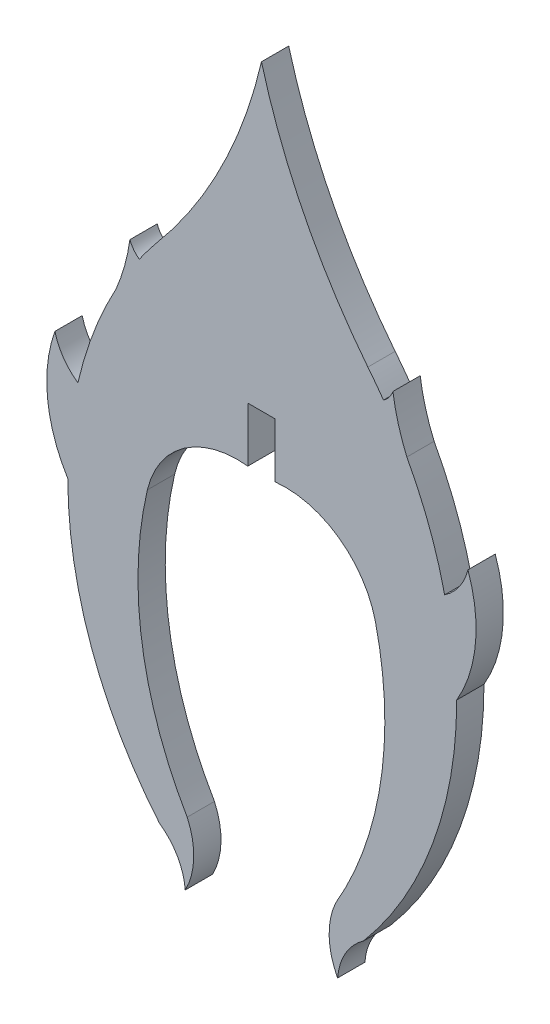
ISO-10303-21;
HEADER;
FILE_DESCRIPTION(('STEP AP214'),'2;1');
FILE_NAME('part.step','',(''),(''),'','','');
FILE_SCHEMA(('AUTOMOTIVE_DESIGN { 1 0 10303 214 1 1 1 1 }'));
ENDSEC;
DATA;
#1=APPLICATION_CONTEXT('core data for automotive mechanical design processes');
#2=APPLICATION_PROTOCOL_DEFINITION('international standard','automotive_design',2000,#1);
#3=PRODUCT_CONTEXT('',#1,'mechanical');
#4=PRODUCT('Part','Part','',(#3));
#5=PRODUCT_RELATED_PRODUCT_CATEGORY('part','',(#4));
#6=PRODUCT_DEFINITION_FORMATION('','',#4);
#7=PRODUCT_DEFINITION_CONTEXT('part definition',#1,'design');
#8=PRODUCT_DEFINITION('design','',#6,#7);
#9=PRODUCT_DEFINITION_SHAPE('','',#8);
#10=(LENGTH_UNIT() NAMED_UNIT(*) SI_UNIT(.MILLI.,.METRE.));
#11=(NAMED_UNIT(*) PLANE_ANGLE_UNIT() SI_UNIT($,.RADIAN.));
#12=(NAMED_UNIT(*) SI_UNIT($,.STERADIAN.) SOLID_ANGLE_UNIT());
#13=UNCERTAINTY_MEASURE_WITH_UNIT(LENGTH_MEASURE(1.E-05),#10,'distance_accuracy_value','');
#14=(GEOMETRIC_REPRESENTATION_CONTEXT(3) GLOBAL_UNCERTAINTY_ASSIGNED_CONTEXT((#13)) GLOBAL_UNIT_ASSIGNED_CONTEXT((#10,
#11,#12)) REPRESENTATION_CONTEXT('',''));
#15=CARTESIAN_POINT('',(0.,0.,0.));
#16=DIRECTION('',(0.,0.,1.));
#17=DIRECTION('',(1.,0.,0.));
#18=AXIS2_PLACEMENT_3D('',#15,#16,#17);
#19=CARTESIAN_POINT('',(-27.1517433252407,27.3412277841627,1.524));
#20=DIRECTION('',(0.,0.,-1.));
#21=DIRECTION('',(-1.,0.,0.));
#22=AXIS2_PLACEMENT_3D('',#19,#20,#21);
#23=CYLINDRICAL_SURFACE('',#22,27.870651253595);
#24=CARTESIAN_POINT('',(-27.1517433252407,27.3412277841627,0.));
#25=DIRECTION('',(0.,0.,-1.));
#26=DIRECTION('',(-1.,0.,0.));
#27=AXIS2_PLACEMENT_3D('',#24,#25,#26);
#28=CIRCLE('',#27,27.870651253595);
#29=CARTESIAN_POINT('',(0.00144628974636102,21.0581158933815,0.));
#30=VERTEX_POINT('',#29);
#31=CARTESIAN_POINT('',(-5.87407849137274,9.34027835039408,0.));
#32=VERTEX_POINT('',#31);
#33=EDGE_CURVE('E244',#30,#32,#28,.T.);
#34=ORIENTED_EDGE('',*,*,#33,.T.);
#35=DIRECTION('',(0.,0.,-1.));
#36=VECTOR('',#35,1.);
#37=CARTESIAN_POINT('',(-5.87407849137274,9.34027835039408,1.524));
#38=LINE('',#37,#36);
#39=CARTESIAN_POINT('',(-5.87407849137274,9.34027835039408,1.524));
#40=VERTEX_POINT('',#39);
#41=EDGE_CURVE('E11',#40,#32,#38,.T.);
#42=ORIENTED_EDGE('',*,*,#41,.F.);
#43=CARTESIAN_POINT('',(-27.1517433252407,27.3412277841627,1.524));
#44=DIRECTION('',(0.,0.,-1.));
#45=DIRECTION('',(-1.,0.,0.));
#46=AXIS2_PLACEMENT_3D('',#43,#44,#45);
#47=CIRCLE('',#46,27.870651253595);
#48=CARTESIAN_POINT('',(0.00144628974636102,21.0581158933815,1.524));
#49=VERTEX_POINT('',#48);
#50=EDGE_CURVE('E296',#49,#40,#47,.T.);
#51=ORIENTED_EDGE('',*,*,#50,.F.);
#52=DIRECTION('',(0.,0.,-1.));
#53=VECTOR('',#52,1.);
#54=CARTESIAN_POINT('',(0.00144628974636102,21.0581158933815,1.524));
#55=LINE('',#54,#53);
#56=EDGE_CURVE('E240',#49,#30,#55,.T.);
#57=ORIENTED_EDGE('',*,*,#56,.T.);
#58=EDGE_LOOP('',(#34,#42,#51,#57));
#59=FACE_BOUND('',#58,.T.);
#60=ADVANCED_FACE('F34',(#59),#23,.F.);
#61=CARTESIAN_POINT('',(11.1595682273208,-4.55209869730225,1.524));
#62=DIRECTION('',(0.,0.,-1.));
#63=DIRECTION('',(-1.,0.,0.));
#64=AXIS2_PLACEMENT_3D('',#61,#62,#63);
#65=CYLINDRICAL_SURFACE('',#64,21.9805200250726);
#66=CARTESIAN_POINT('',(11.1595682273208,-4.55209869730225,0.));
#67=DIRECTION('',(0.,0.,1.));
#68=DIRECTION('',(1.,0.,0.));
#69=AXIS2_PLACEMENT_3D('',#66,#67,#68);
#70=CIRCLE('',#69,21.9805200250726);
#71=CARTESIAN_POINT('',(-6.82276873056305,8.08826593769716,0.));
#72=VERTEX_POINT('',#71);
#73=EDGE_CURVE('E247',#32,#72,#70,.T.);
#74=ORIENTED_EDGE('',*,*,#73,.T.);
#75=DIRECTION('',(0.,0.,-1.));
#76=VECTOR('',#75,1.);
#77=CARTESIAN_POINT('',(-6.82276873056305,8.08826593769716,1.524));
#78=LINE('',#77,#76);
#79=CARTESIAN_POINT('',(-6.82276873056305,8.08826593769716,1.524));
#80=VERTEX_POINT('',#79);
#81=EDGE_CURVE('E42',#80,#72,#78,.T.);
#82=ORIENTED_EDGE('',*,*,#81,.F.);
#83=CARTESIAN_POINT('',(11.1595682273208,-4.55209869730225,1.524));
#84=DIRECTION('',(0.,0.,1.));
#85=DIRECTION('',(1.,0.,0.));
#86=AXIS2_PLACEMENT_3D('',#83,#84,#85);
#87=CIRCLE('',#86,21.9805200250726);
#88=EDGE_CURVE('E150',#40,#80,#87,.T.);
#89=ORIENTED_EDGE('',*,*,#88,.F.);
#90=ORIENTED_EDGE('',*,*,#41,.T.);
#91=EDGE_LOOP('',(#74,#82,#89,#90));
#92=FACE_BOUND('',#91,.T.);
#93=ADVANCED_FACE('F449',(#92),#65,.T.);
#94=CARTESIAN_POINT('',(-6.04422455175035,9.23484483292326,1.524));
#95=DIRECTION('',(0.,0.,-1.));
#96=DIRECTION('',(-1.,0.,0.));
#97=AXIS2_PLACEMENT_3D('',#94,#95,#96);
#98=CYLINDRICAL_SURFACE('',#97,1.38591998374403);
#99=CARTESIAN_POINT('',(-6.04422455175035,9.23484483292326,0.));
#100=DIRECTION('',(0.,0.,-1.));
#101=DIRECTION('',(1.,0.,0.));
#102=AXIS2_PLACEMENT_3D('',#99,#100,#101);
#103=CIRCLE('',#102,1.38591998374403);
#104=CARTESIAN_POINT('',(-7.35061102312265,8.77210452912805,0.));
#105=VERTEX_POINT('',#104);
#106=EDGE_CURVE('E249',#72,#105,#103,.T.);
#107=ORIENTED_EDGE('',*,*,#106,.T.);
#108=DIRECTION('',(0.,0.,-1.));
#109=VECTOR('',#108,1.);
#110=CARTESIAN_POINT('',(-7.35061102312265,8.77210452912805,1.524));
#111=LINE('',#110,#109);
#112=CARTESIAN_POINT('',(-7.35061102312265,8.77210452912805,1.524));
#113=VERTEX_POINT('',#112);
#114=EDGE_CURVE('E360',#113,#105,#111,.T.);
#115=ORIENTED_EDGE('',*,*,#114,.F.);
#116=CARTESIAN_POINT('',(-6.04422455175035,9.23484483292326,1.524));
#117=DIRECTION('',(0.,0.,-1.));
#118=DIRECTION('',(1.,0.,0.));
#119=AXIS2_PLACEMENT_3D('',#116,#117,#118);
#120=CIRCLE('',#119,1.38591998374403);
#121=EDGE_CURVE('E368',#80,#113,#120,.T.);
#122=ORIENTED_EDGE('',*,*,#121,.F.);
#123=ORIENTED_EDGE('',*,*,#81,.T.);
#124=EDGE_LOOP('',(#107,#115,#122,#123));
#125=FACE_BOUND('',#124,.T.);
#126=ADVANCED_FACE('F366',(#125),#98,.F.);
#127=CARTESIAN_POINT('',(-18.1457346245351,10.289915583022,1.524));
#128=DIRECTION('',(0.,0.,-1.));
#129=DIRECTION('',(-1.,0.,0.));
#130=AXIS2_PLACEMENT_3D('',#127,#128,#129);
#131=CYLINDRICAL_SURFACE('',#130,10.9013046909577);
#132=CARTESIAN_POINT('',(-18.1457346245351,10.289915583022,0.));
#133=DIRECTION('',(0.,0.,-1.));
#134=DIRECTION('',(1.,0.,0.));
#135=AXIS2_PLACEMENT_3D('',#132,#133,#134);
#136=CIRCLE('',#135,10.9013046909577);
#137=CARTESIAN_POINT('',(-8.12963345957072,5.98687463291546,0.));
#138=VERTEX_POINT('',#137);
#139=EDGE_CURVE('E251',#105,#138,#136,.T.);
#140=ORIENTED_EDGE('',*,*,#139,.T.);
#141=DIRECTION('',(0.,0.,-1.));
#142=VECTOR('',#141,1.);
#143=CARTESIAN_POINT('',(-8.12963345957072,5.98687463291546,1.524));
#144=LINE('',#143,#142);
#145=CARTESIAN_POINT('',(-8.12963345957072,5.98687463291546,1.524));
#146=VERTEX_POINT('',#145);
#147=EDGE_CURVE('E357',#146,#138,#144,.T.);
#148=ORIENTED_EDGE('',*,*,#147,.F.);
#149=CARTESIAN_POINT('',(-18.1457346245351,10.289915583022,1.524));
#150=DIRECTION('',(0.,0.,-1.));
#151=DIRECTION('',(1.,0.,0.));
#152=AXIS2_PLACEMENT_3D('',#149,#150,#151);
#153=CIRCLE('',#152,10.9013046909577);
#154=EDGE_CURVE('E386',#113,#146,#153,.T.);
#155=ORIENTED_EDGE('',*,*,#154,.F.);
#156=ORIENTED_EDGE('',*,*,#114,.T.);
#157=EDGE_LOOP('',(#140,#148,#155,#156));
#158=FACE_BOUND('',#157,.T.);
#159=ADVANCED_FACE('F377',(#158),#131,.F.);
#160=CARTESIAN_POINT('',(11.1595682273208,-4.55209869730225,1.524));
#161=DIRECTION('',(0.,0.,-1.));
#162=DIRECTION('',(-1.,0.,0.));
#163=AXIS2_PLACEMENT_3D('',#160,#161,#162);
#164=CYLINDRICAL_SURFACE('',#163,21.9805200250726);
#165=CARTESIAN_POINT('',(11.1595682273208,-4.55209869730225,0.));
#166=DIRECTION('',(0.,0.,1.));
#167=DIRECTION('',(1.,0.,0.));
#168=AXIS2_PLACEMENT_3D('',#165,#166,#167);
#169=CIRCLE('',#168,21.9805200250726);
#170=CARTESIAN_POINT('',(-10.2596853974464,0.383368325231446,0.));
#171=VERTEX_POINT('',#170);
#172=EDGE_CURVE('E253',#138,#171,#169,.T.);
#173=ORIENTED_EDGE('',*,*,#172,.T.);
#174=DIRECTION('',(0.,0.,-1.));
#175=VECTOR('',#174,1.);
#176=CARTESIAN_POINT('',(-10.2596853974464,0.383368325231446,1.524));
#177=LINE('',#176,#175);
#178=CARTESIAN_POINT('',(-10.2596853974464,0.383368325231446,1.524));
#179=VERTEX_POINT('',#178);
#180=EDGE_CURVE('E354',#179,#171,#177,.T.);
#181=ORIENTED_EDGE('',*,*,#180,.F.);
#182=CARTESIAN_POINT('',(11.1595682273208,-4.55209869730225,1.524));
#183=DIRECTION('',(0.,0.,1.));
#184=DIRECTION('',(1.,0.,0.));
#185=AXIS2_PLACEMENT_3D('',#182,#183,#184);
#186=CIRCLE('',#185,21.9805200250726);
#187=EDGE_CURVE('E383',#146,#179,#186,.T.);
#188=ORIENTED_EDGE('',*,*,#187,.F.);
#189=ORIENTED_EDGE('',*,*,#147,.T.);
#190=EDGE_LOOP('',(#173,#181,#188,#189));
#191=FACE_BOUND('',#190,.T.);
#192=ADVANCED_FACE('F381',(#191),#164,.T.);
#193=CARTESIAN_POINT('',(-8.44385747613627,3.01323786753467,1.524));
#194=DIRECTION('',(0.,0.,-1.));
#195=DIRECTION('',(-1.,0.,0.));
#196=AXIS2_PLACEMENT_3D('',#193,#194,#195);
#197=CYLINDRICAL_SURFACE('',#196,3.1958480641832);
#198=CARTESIAN_POINT('',(-8.44385747613627,3.01323786753467,0.));
#199=DIRECTION('',(0.,0.,-1.));
#200=DIRECTION('',(-1.,0.,0.));
#201=AXIS2_PLACEMENT_3D('',#198,#199,#200);
#202=CIRCLE('',#201,3.1958480641832);
#203=CARTESIAN_POINT('',(-11.5436828902103,2.23572436179703,0.));
#204=VERTEX_POINT('',#203);
#205=EDGE_CURVE('E255',#171,#204,#202,.T.);
#206=ORIENTED_EDGE('',*,*,#205,.T.);
#207=DIRECTION('',(0.,0.,-1.));
#208=VECTOR('',#207,1.);
#209=CARTESIAN_POINT('',(-11.5436828902103,2.23572436179703,1.524));
#210=LINE('',#209,#208);
#211=CARTESIAN_POINT('',(-11.5436828902103,2.23572436179703,1.524));
#212=VERTEX_POINT('',#211);
#213=EDGE_CURVE('E351',#212,#204,#210,.T.);
#214=ORIENTED_EDGE('',*,*,#213,.F.);
#215=CARTESIAN_POINT('',(-8.44385747613627,3.01323786753467,1.524));
#216=DIRECTION('',(0.,0.,-1.));
#217=DIRECTION('',(-1.,0.,0.));
#218=AXIS2_PLACEMENT_3D('',#215,#216,#217);
#219=CIRCLE('',#218,3.1958480641832);
#220=EDGE_CURVE('E385',#179,#212,#219,.T.);
#221=ORIENTED_EDGE('',*,*,#220,.F.);
#222=ORIENTED_EDGE('',*,*,#180,.T.);
#223=EDGE_LOOP('',(#206,#214,#221,#222));
#224=FACE_BOUND('',#223,.T.);
#225=ADVANCED_FACE('F462',(#224),#197,.F.);
#226=CARTESIAN_POINT('',(-4.14373430607097,-0.399614952941683,1.524));
#227=DIRECTION('',(0.,0.,-1.));
#228=DIRECTION('',(-1.,0.,0.));
#229=AXIS2_PLACEMENT_3D('',#226,#227,#228);
#230=CYLINDRICAL_SURFACE('',#229,7.85520543026806);
#231=CARTESIAN_POINT('',(-4.14373430607097,-0.399614952941683,0.));
#232=DIRECTION('',(0.,0.,1.));
#233=DIRECTION('',(-1.,0.,0.));
#234=AXIS2_PLACEMENT_3D('',#231,#232,#233);
#235=CIRCLE('',#234,7.85520543026806);
#236=CARTESIAN_POINT('',(-10.820946705543,-4.53713678660617,0.));
#237=VERTEX_POINT('',#236);
#238=EDGE_CURVE('E257',#204,#237,#235,.T.);
#239=ORIENTED_EDGE('',*,*,#238,.T.);
#240=DIRECTION('',(0.,0.,-1.));
#241=VECTOR('',#240,1.);
#242=CARTESIAN_POINT('',(-10.820946705543,-4.53713678660617,1.524));
#243=LINE('',#242,#241);
#244=CARTESIAN_POINT('',(-10.820946705543,-4.53713678660617,1.524));
#245=VERTEX_POINT('',#244);
#246=EDGE_CURVE('E348',#245,#237,#243,.T.);
#247=ORIENTED_EDGE('',*,*,#246,.F.);
#248=CARTESIAN_POINT('',(-4.14373430607097,-0.399614952941683,1.524));
#249=DIRECTION('',(0.,0.,1.));
#250=DIRECTION('',(-1.,0.,0.));
#251=AXIS2_PLACEMENT_3D('',#248,#249,#250);
#252=CIRCLE('',#251,7.85520543026806);
#253=EDGE_CURVE('E388',#212,#245,#252,.T.);
#254=ORIENTED_EDGE('',*,*,#253,.F.);
#255=ORIENTED_EDGE('',*,*,#213,.T.);
#256=EDGE_LOOP('',(#239,#247,#254,#255));
#257=FACE_BOUND('',#256,.T.);
#258=ADVANCED_FACE('F465',(#257),#230,.T.);
#259=CARTESIAN_POINT('',(11.1595682273208,-4.55209869730225,1.524));
#260=DIRECTION('',(0.,0.,-1.));
#261=DIRECTION('',(-1.,0.,0.));
#262=AXIS2_PLACEMENT_3D('',#259,#260,#261);
#263=CYLINDRICAL_SURFACE('',#262,21.9805200250726);
#264=CARTESIAN_POINT('',(11.1595682273208,-4.55209869730225,0.));
#265=DIRECTION('',(0.,0.,1.));
#266=DIRECTION('',(1.,0.,0.));
#267=AXIS2_PLACEMENT_3D('',#264,#265,#266);
#268=CIRCLE('',#267,21.9805200250726);
#269=CARTESIAN_POINT('',(-5.69524722856263,-18.6609064612748,0.));
#270=VERTEX_POINT('',#269);
#271=EDGE_CURVE('E259',#237,#270,#268,.T.);
#272=ORIENTED_EDGE('',*,*,#271,.T.);
#273=DIRECTION('',(0.,0.,-1.));
#274=VECTOR('',#273,1.);
#275=CARTESIAN_POINT('',(-5.69524722856263,-18.6609064612748,1.524));
#276=LINE('',#275,#274);
#277=CARTESIAN_POINT('',(-5.69524722856263,-18.6609064612748,1.524));
#278=VERTEX_POINT('',#277);
#279=EDGE_CURVE('E345',#278,#270,#276,.T.);
#280=ORIENTED_EDGE('',*,*,#279,.F.);
#281=CARTESIAN_POINT('',(11.1595682273208,-4.55209869730225,1.524));
#282=DIRECTION('',(0.,0.,1.));
#283=DIRECTION('',(1.,0.,0.));
#284=AXIS2_PLACEMENT_3D('',#281,#282,#283);
#285=CIRCLE('',#284,21.9805200250726);
#286=EDGE_CURVE('E394',#245,#278,#285,.T.);
#287=ORIENTED_EDGE('',*,*,#286,.F.);
#288=ORIENTED_EDGE('',*,*,#246,.T.);
#289=EDGE_LOOP('',(#272,#280,#287,#288));
#290=FACE_BOUND('',#289,.T.);
#291=ADVANCED_FACE('F469',(#290),#263,.T.);
#292=CARTESIAN_POINT('',(-7.62907031332419,-21.4338274519076,1.524));
#293=DIRECTION('',(0.,0.,-1.));
#294=DIRECTION('',(-1.,0.,0.));
#295=AXIS2_PLACEMENT_3D('',#292,#293,#294);
#296=CYLINDRICAL_SURFACE('',#295,3.38064528506745);
#297=CARTESIAN_POINT('',(-7.62907031332419,-21.4338274519076,0.));
#298=DIRECTION('',(0.,0.,-1.));
#299=DIRECTION('',(1.,0.,0.));
#300=AXIS2_PLACEMENT_3D('',#297,#298,#299);
#301=CIRCLE('',#300,3.38064528506745);
#302=CARTESIAN_POINT('',(-4.25888626951641,-21.168079348787,0.));
#303=VERTEX_POINT('',#302);
#304=EDGE_CURVE('E261',#270,#303,#301,.T.);
#305=ORIENTED_EDGE('',*,*,#304,.T.);
#306=DIRECTION('',(0.,0.,-1.));
#307=VECTOR('',#306,1.);
#308=CARTESIAN_POINT('',(-4.25888626951641,-21.168079348787,1.524));
#309=LINE('',#308,#307);
#310=CARTESIAN_POINT('',(-4.25888626951641,-21.168079348787,1.524));
#311=VERTEX_POINT('',#310);
#312=EDGE_CURVE('E342',#311,#303,#309,.T.);
#313=ORIENTED_EDGE('',*,*,#312,.F.);
#314=CARTESIAN_POINT('',(-7.62907031332419,-21.4338274519076,1.524));
#315=DIRECTION('',(0.,0.,-1.));
#316=DIRECTION('',(1.,0.,0.));
#317=AXIS2_PLACEMENT_3D('',#314,#315,#316);
#318=CIRCLE('',#317,3.38064528506745);
#319=EDGE_CURVE('E396',#278,#311,#318,.T.);
#320=ORIENTED_EDGE('',*,*,#319,.F.);
#321=ORIENTED_EDGE('',*,*,#279,.T.);
#322=EDGE_LOOP('',(#305,#313,#320,#321));
#323=FACE_BOUND('',#322,.T.);
#324=ADVANCED_FACE('F473',(#323),#296,.F.);
#325=CARTESIAN_POINT('',(-7.81808829376631,-19.2688849772693,1.524));
#326=DIRECTION('',(0.,0.,-1.));
#327=DIRECTION('',(-1.,0.,0.));
#328=AXIS2_PLACEMENT_3D('',#325,#326,#327);
#329=CYLINDRICAL_SURFACE('',#328,4.03421098980072);
#330=CARTESIAN_POINT('',(-7.81808829376631,-19.2688849772693,0.));
#331=DIRECTION('',(0.,0.,1.));
#332=DIRECTION('',(-1.,0.,0.));
#333=AXIS2_PLACEMENT_3D('',#330,#331,#332);
#334=CIRCLE('',#333,4.03421098980072);
#335=CARTESIAN_POINT('',(-4.15145375869857,-17.5864315614276,0.));
#336=VERTEX_POINT('',#335);
#337=EDGE_CURVE('E263',#303,#336,#334,.T.);
#338=ORIENTED_EDGE('',*,*,#337,.T.);
#339=DIRECTION('',(0.,0.,-1.));
#340=VECTOR('',#339,1.);
#341=CARTESIAN_POINT('',(-4.15145375869857,-17.5864315614276,1.524));
#342=LINE('',#341,#340);
#343=CARTESIAN_POINT('',(-4.15145375869857,-17.5864315614276,1.524));
#344=VERTEX_POINT('',#343);
#345=EDGE_CURVE('E339',#344,#336,#342,.T.);
#346=ORIENTED_EDGE('',*,*,#345,.F.);
#347=CARTESIAN_POINT('',(-7.81808829376631,-19.2688849772693,1.524));
#348=DIRECTION('',(0.,0.,1.));
#349=DIRECTION('',(-1.,0.,0.));
#350=AXIS2_PLACEMENT_3D('',#347,#348,#349);
#351=CIRCLE('',#350,4.03421098980072);
#352=EDGE_CURVE('E398',#311,#344,#351,.T.);
#353=ORIENTED_EDGE('',*,*,#352,.F.);
#354=ORIENTED_EDGE('',*,*,#312,.T.);
#355=EDGE_LOOP('',(#338,#346,#353,#354));
#356=FACE_BOUND('',#355,.T.);
#357=ADVANCED_FACE('F477',(#356),#329,.T.);
#358=CARTESIAN_POINT('',(13.2385285381102,-7.42792107708707,1.524));
#359=DIRECTION('',(0.,0.,-1.));
#360=DIRECTION('',(-1.,0.,0.));
#361=AXIS2_PLACEMENT_3D('',#358,#359,#360);
#362=CYLINDRICAL_SURFACE('',#361,20.1396827071277);
#363=CARTESIAN_POINT('',(13.2385285381102,-7.42792107708707,0.));
#364=DIRECTION('',(0.,0.,-1.));
#365=DIRECTION('',(1.,0.,0.));
#366=AXIS2_PLACEMENT_3D('',#363,#364,#365);
#367=CIRCLE('',#366,20.1396827071277);
#368=CARTESIAN_POINT('',(-6.37541064665351,-2.8562464167279,0.));
#369=VERTEX_POINT('',#368);
#370=EDGE_CURVE('E265',#336,#369,#367,.T.);
#371=ORIENTED_EDGE('',*,*,#370,.T.);
#372=DIRECTION('',(0.,0.,-1.));
#373=VECTOR('',#372,1.);
#374=CARTESIAN_POINT('',(-6.37541064665351,-2.8562464167279,1.524));
#375=LINE('',#374,#373);
#376=CARTESIAN_POINT('',(-6.37541064665351,-2.8562464167279,1.524));
#377=VERTEX_POINT('',#376);
#378=EDGE_CURVE('E336',#377,#369,#375,.T.);
#379=ORIENTED_EDGE('',*,*,#378,.F.);
#380=CARTESIAN_POINT('',(13.2385285381102,-7.42792107708707,1.524));
#381=DIRECTION('',(0.,0.,-1.));
#382=DIRECTION('',(1.,0.,0.));
#383=AXIS2_PLACEMENT_3D('',#380,#381,#382);
#384=CIRCLE('',#383,20.1396827071277);
#385=EDGE_CURVE('E400',#344,#377,#384,.T.);
#386=ORIENTED_EDGE('',*,*,#385,.F.);
#387=ORIENTED_EDGE('',*,*,#345,.T.);
#388=EDGE_LOOP('',(#371,#379,#386,#387));
#389=FACE_BOUND('',#388,.T.);
#390=ADVANCED_FACE('F481',(#389),#362,.F.);
#391=CARTESIAN_POINT('',(-1.3416908068585,-4.03797831769905,1.524));
#392=DIRECTION('',(0.,0.,-1.));
#393=DIRECTION('',(-1.,0.,0.));
#394=AXIS2_PLACEMENT_3D('',#391,#392,#393);
#395=CYLINDRICAL_SURFACE('',#394,5.17057305444172);
#396=CARTESIAN_POINT('',(-1.3416908068585,-4.03797831769905,0.));
#397=DIRECTION('',(0.,0.,-1.));
#398=DIRECTION('',(1.,0.,0.));
#399=AXIS2_PLACEMENT_3D('',#396,#397,#398);
#400=CIRCLE('',#399,5.17057305444172);
#401=CARTESIAN_POINT('',(-0.762909271678956,1.1000989146763,0.));
#402=VERTEX_POINT('',#401);
#403=EDGE_CURVE('E267',#369,#402,#400,.T.);
#404=ORIENTED_EDGE('',*,*,#403,.T.);
#405=DIRECTION('',(0.,0.,-1.));
#406=VECTOR('',#405,1.);
#407=CARTESIAN_POINT('',(-0.762909271678956,1.1000989146763,1.524));
#408=LINE('',#407,#406);
#409=CARTESIAN_POINT('',(-0.762909271678956,1.1000989146763,1.524));
#410=VERTEX_POINT('',#409);
#411=EDGE_CURVE('E333',#410,#402,#408,.T.);
#412=ORIENTED_EDGE('',*,*,#411,.F.);
#413=CARTESIAN_POINT('',(-1.3416908068585,-4.03797831769905,1.524));
#414=DIRECTION('',(0.,0.,-1.));
#415=DIRECTION('',(1.,0.,0.));
#416=AXIS2_PLACEMENT_3D('',#413,#414,#415);
#417=CIRCLE('',#416,5.17057305444172);
#418=EDGE_CURVE('E402',#377,#410,#417,.T.);
#419=ORIENTED_EDGE('',*,*,#418,.F.);
#420=ORIENTED_EDGE('',*,*,#378,.T.);
#421=EDGE_LOOP('',(#404,#412,#419,#420));
#422=FACE_BOUND('',#421,.T.);
#423=ADVANCED_FACE('F485',(#422),#395,.F.);
#424=CARTESIAN_POINT('',(-0.762909271678956,1.1000989146763,1.524));
#425=DIRECTION('',(-0.999999999351863,3.60037912165858E-05,0.));
#426=DIRECTION('',(-3.60037912165858E-05,-0.999999999351864,0.));
#427=AXIS2_PLACEMENT_3D('',#424,#425,#426);
#428=PLANE('',#427);
#429=DIRECTION('',(3.60037912165858E-05,0.999999999351863,0.));
#430=VECTOR('',#429,1.);
#431=CARTESIAN_POINT('',(-0.762909271678956,1.1000989146763,0.));
#432=LINE('',#431,#430);
#433=CARTESIAN_POINT('',(-0.762799401036095,4.15173984130386,0.));
#434=VERTEX_POINT('',#433);
#435=EDGE_CURVE('E269',#402,#434,#432,.T.);
#436=ORIENTED_EDGE('',*,*,#435,.T.);
#437=DIRECTION('',(0.,0.,-1.));
#438=VECTOR('',#437,1.);
#439=CARTESIAN_POINT('',(-0.762799401036095,4.15173984130386,1.524));
#440=LINE('',#439,#438);
#441=CARTESIAN_POINT('',(-0.762799401036095,4.15173984130386,1.524));
#442=VERTEX_POINT('',#441);
#443=EDGE_CURVE('E330',#442,#434,#440,.T.);
#444=ORIENTED_EDGE('',*,*,#443,.F.);
#445=DIRECTION('',(3.60037912165858E-05,0.999999999351863,0.));
#446=VECTOR('',#445,1.);
#447=CARTESIAN_POINT('',(-0.762909271678956,1.1000989146763,1.524));
#448=LINE('',#447,#446);
#449=EDGE_CURVE('E404',#410,#442,#448,.T.);
#450=ORIENTED_EDGE('',*,*,#449,.F.);
#451=ORIENTED_EDGE('',*,*,#411,.T.);
#452=EDGE_LOOP('',(#436,#444,#450,#451));
#453=FACE_BOUND('',#452,.T.);
#454=ADVANCED_FACE('F489',(#453),#428,.F.);
#455=CARTESIAN_POINT('',(-0.762799401036095,4.15173984130386,1.524));
#456=DIRECTION('',(-0.000650999861732325,0.999999788099567,0.));
#457=DIRECTION('',(-0.999999788099568,-0.000650999861732326,0.));
#458=AXIS2_PLACEMENT_3D('',#455,#456,#457);
#459=PLANE('',#458);
#460=DIRECTION('',(0.999999788099568,0.000650999861732326,0.));
#461=VECTOR('',#460,1.);
#462=CARTESIAN_POINT('',(-0.762799401036095,4.15173984130386,0.));
#463=LINE('',#462,#461);
#464=CARTESIAN_POINT('',(0.763181798963911,4.15273325506457,0.));
#465=VERTEX_POINT('',#464);
#466=EDGE_CURVE('E271',#434,#465,#463,.T.);
#467=ORIENTED_EDGE('',*,*,#466,.T.);
#468=DIRECTION('',(0.,0.,-1.));
#469=VECTOR('',#468,1.);
#470=CARTESIAN_POINT('',(0.763181798963911,4.15273325506457,1.524));
#471=LINE('',#470,#469);
#472=CARTESIAN_POINT('',(0.763181798963911,4.15273325506457,1.524));
#473=VERTEX_POINT('',#472);
#474=EDGE_CURVE('E327',#473,#465,#471,.T.);
#475=ORIENTED_EDGE('',*,*,#474,.F.);
#476=DIRECTION('',(0.999999788099568,0.000650999861732326,0.));
#477=VECTOR('',#476,1.);
#478=CARTESIAN_POINT('',(-0.762799401036095,4.15173984130386,1.524));
#479=LINE('',#478,#477);
#480=EDGE_CURVE('E406',#442,#473,#479,.T.);
#481=ORIENTED_EDGE('',*,*,#480,.F.);
#482=ORIENTED_EDGE('',*,*,#443,.T.);
#483=EDGE_LOOP('',(#467,#475,#481,#482));
#484=FACE_BOUND('',#483,.T.);
#485=ADVANCED_FACE('F493',(#484),#459,.F.);
#486=CARTESIAN_POINT('',(0.763181798963911,4.15273325506457,1.524));
#487=DIRECTION('',(1.,0.,0.));
#488=DIRECTION('',(0.,0.,-1.));
#489=AXIS2_PLACEMENT_3D('',#486,#487,#488);
#490=PLANE('',#489);
#491=DIRECTION('',(0.,-1.,0.));
#492=VECTOR('',#491,1.);
#493=CARTESIAN_POINT('',(0.763181798963911,4.15273325506457,0.));
#494=LINE('',#493,#492);
#495=CARTESIAN_POINT('',(0.76318179896391,1.1017642688253,0.));
#496=VERTEX_POINT('',#495);
#497=EDGE_CURVE('E273',#465,#496,#494,.T.);
#498=ORIENTED_EDGE('',*,*,#497,.T.);
#499=DIRECTION('',(0.,0.,-1.));
#500=VECTOR('',#499,1.);
#501=CARTESIAN_POINT('',(0.76318179896391,1.1017642688253,1.524));
#502=LINE('',#501,#500);
#503=CARTESIAN_POINT('',(0.76318179896391,1.1017642688253,1.524));
#504=VERTEX_POINT('',#503);
#505=EDGE_CURVE('E324',#504,#496,#502,.T.);
#506=ORIENTED_EDGE('',*,*,#505,.F.);
#507=DIRECTION('',(0.,-1.,0.));
#508=VECTOR('',#507,1.);
#509=CARTESIAN_POINT('',(0.763181798963911,4.15273325506457,1.524));
#510=LINE('',#509,#508);
#511=EDGE_CURVE('E408',#473,#504,#510,.T.);
#512=ORIENTED_EDGE('',*,*,#511,.F.);
#513=ORIENTED_EDGE('',*,*,#474,.T.);
#514=EDGE_LOOP('',(#498,#506,#512,#513));
#515=FACE_BOUND('',#514,.T.);
#516=ADVANCED_FACE('F497',(#515),#490,.F.);
#517=CARTESIAN_POINT('',(1.33665844214218,-4.03696177602516,1.524));
#518=DIRECTION('',(0.,0.,-1.));
#519=DIRECTION('',(-1.,0.,0.));
#520=AXIS2_PLACEMENT_3D('',#517,#518,#519);
#521=CYLINDRICAL_SURFACE('',#520,5.17062673418759);
#522=CARTESIAN_POINT('',(1.33665844214218,-4.03696177602516,0.));
#523=DIRECTION('',(0.,0.,-1.));
#524=DIRECTION('',(1.,0.,0.));
#525=AXIS2_PLACEMENT_3D('',#522,#523,#524);
#526=CIRCLE('',#525,5.17062673418759);
#527=CARTESIAN_POINT('',(6.37138550218982,-2.85929278385481,0.));
#528=VERTEX_POINT('',#527);
#529=EDGE_CURVE('E275',#496,#528,#526,.T.);
#530=ORIENTED_EDGE('',*,*,#529,.T.);
#531=DIRECTION('',(0.,0.,-1.));
#532=VECTOR('',#531,1.);
#533=CARTESIAN_POINT('',(6.37138550218982,-2.85929278385481,1.524));
#534=LINE('',#533,#532);
#535=CARTESIAN_POINT('',(6.37138550218982,-2.85929278385481,1.524));
#536=VERTEX_POINT('',#535);
#537=EDGE_CURVE('E321',#536,#528,#534,.T.);
#538=ORIENTED_EDGE('',*,*,#537,.F.);
#539=CARTESIAN_POINT('',(1.33665844214218,-4.03696177602516,1.524));
#540=DIRECTION('',(0.,0.,-1.));
#541=DIRECTION('',(1.,0.,0.));
#542=AXIS2_PLACEMENT_3D('',#539,#540,#541);
#543=CIRCLE('',#542,5.17062673418759);
#544=EDGE_CURVE('E410',#504,#536,#543,.T.);
#545=ORIENTED_EDGE('',*,*,#544,.F.);
#546=ORIENTED_EDGE('',*,*,#505,.T.);
#547=EDGE_LOOP('',(#530,#538,#545,#546));
#548=FACE_BOUND('',#547,.T.);
#549=ADVANCED_FACE('F501',(#548),#521,.F.);
#550=CARTESIAN_POINT('',(-13.2424731868988,-7.43318041623301,1.524));
#551=DIRECTION('',(0.,0.,-1.));
#552=DIRECTION('',(-1.,0.,0.));
#553=AXIS2_PLACEMENT_3D('',#550,#551,#552);
#554=CYLINDRICAL_SURFACE('',#553,20.1401067710467);
#555=CARTESIAN_POINT('',(-13.2424731868988,-7.43318041623301,0.));
#556=DIRECTION('',(0.,0.,-1.));
#557=DIRECTION('',(1.,0.,0.));
#558=AXIS2_PLACEMENT_3D('',#555,#556,#557);
#559=CIRCLE('',#558,20.1401067710467);
#560=CARTESIAN_POINT('',(4.1510713607707,-17.5864315614276,0.));
#561=VERTEX_POINT('',#560);
#562=EDGE_CURVE('E277',#528,#561,#559,.T.);
#563=ORIENTED_EDGE('',*,*,#562,.T.);
#564=DIRECTION('',(0.,0.,-1.));
#565=VECTOR('',#564,1.);
#566=CARTESIAN_POINT('',(4.1510713607707,-17.5864315614276,1.524));
#567=LINE('',#566,#565);
#568=CARTESIAN_POINT('',(4.1510713607707,-17.5864315614276,1.524));
#569=VERTEX_POINT('',#568);
#570=EDGE_CURVE('E318',#569,#561,#567,.T.);
#571=ORIENTED_EDGE('',*,*,#570,.F.);
#572=CARTESIAN_POINT('',(-13.2424731868988,-7.43318041623301,1.524));
#573=DIRECTION('',(0.,0.,-1.));
#574=DIRECTION('',(1.,0.,0.));
#575=AXIS2_PLACEMENT_3D('',#572,#573,#574);
#576=CIRCLE('',#575,20.1401067710467);
#577=EDGE_CURVE('E412',#536,#569,#576,.T.);
#578=ORIENTED_EDGE('',*,*,#577,.F.);
#579=ORIENTED_EDGE('',*,*,#537,.T.);
#580=EDGE_LOOP('',(#563,#571,#578,#579));
#581=FACE_BOUND('',#580,.T.);
#582=ADVANCED_FACE('F505',(#581),#554,.F.);
#583=CARTESIAN_POINT('',(7.81770589583845,-19.2688849772693,1.524));
#584=DIRECTION('',(0.,0.,-1.));
#585=DIRECTION('',(-1.,0.,0.));
#586=AXIS2_PLACEMENT_3D('',#583,#584,#585);
#587=CYLINDRICAL_SURFACE('',#586,4.03421098980072);
#588=CARTESIAN_POINT('',(7.81770589583845,-19.2688849772693,0.));
#589=DIRECTION('',(0.,0.,1.));
#590=DIRECTION('',(1.,0.,0.));
#591=AXIS2_PLACEMENT_3D('',#588,#589,#590);
#592=CIRCLE('',#591,4.03421098980072);
#593=CARTESIAN_POINT('',(4.25850387158855,-21.168079348787,0.));
#594=VERTEX_POINT('',#593);
#595=EDGE_CURVE('E279',#561,#594,#592,.T.);
#596=ORIENTED_EDGE('',*,*,#595,.T.);
#597=DIRECTION('',(0.,0.,-1.));
#598=VECTOR('',#597,1.);
#599=CARTESIAN_POINT('',(4.25850387158855,-21.168079348787,1.524));
#600=LINE('',#599,#598);
#601=CARTESIAN_POINT('',(4.25850387158855,-21.168079348787,1.524));
#602=VERTEX_POINT('',#601);
#603=EDGE_CURVE('E315',#602,#594,#600,.T.);
#604=ORIENTED_EDGE('',*,*,#603,.F.);
#605=CARTESIAN_POINT('',(7.81770589583845,-19.2688849772693,1.524));
#606=DIRECTION('',(0.,0.,1.));
#607=DIRECTION('',(1.,0.,0.));
#608=AXIS2_PLACEMENT_3D('',#605,#606,#607);
#609=CIRCLE('',#608,4.03421098980072);
#610=EDGE_CURVE('E414',#569,#602,#609,.T.);
#611=ORIENTED_EDGE('',*,*,#610,.F.);
#612=ORIENTED_EDGE('',*,*,#570,.T.);
#613=EDGE_LOOP('',(#596,#604,#611,#612));
#614=FACE_BOUND('',#613,.T.);
#615=ADVANCED_FACE('F509',(#614),#587,.T.);
#616=CARTESIAN_POINT('',(7.62868791539633,-21.4338274519076,1.524));
#617=DIRECTION('',(0.,0.,-1.));
#618=DIRECTION('',(-1.,0.,0.));
#619=AXIS2_PLACEMENT_3D('',#616,#617,#618);
#620=CYLINDRICAL_SURFACE('',#619,3.38064528506745);
#621=CARTESIAN_POINT('',(7.62868791539633,-21.4338274519076,0.));
#622=DIRECTION('',(0.,0.,-1.));
#623=DIRECTION('',(-1.,0.,0.));
#624=AXIS2_PLACEMENT_3D('',#621,#622,#623);
#625=CIRCLE('',#624,3.38064528506745);
#626=CARTESIAN_POINT('',(5.69486483063476,-18.6609064612748,0.));
#627=VERTEX_POINT('',#626);
#628=EDGE_CURVE('E281',#594,#627,#625,.T.);
#629=ORIENTED_EDGE('',*,*,#628,.T.);
#630=DIRECTION('',(0.,0.,-1.));
#631=VECTOR('',#630,1.);
#632=CARTESIAN_POINT('',(5.69486483063476,-18.6609064612748,1.524));
#633=LINE('',#632,#631);
#634=CARTESIAN_POINT('',(5.69486483063476,-18.6609064612748,1.524));
#635=VERTEX_POINT('',#634);
#636=EDGE_CURVE('E312',#635,#627,#633,.T.);
#637=ORIENTED_EDGE('',*,*,#636,.F.);
#638=CARTESIAN_POINT('',(7.62868791539633,-21.4338274519076,1.524));
#639=DIRECTION('',(0.,0.,-1.));
#640=DIRECTION('',(-1.,0.,0.));
#641=AXIS2_PLACEMENT_3D('',#638,#639,#640);
#642=CIRCLE('',#641,3.38064528506745);
#643=EDGE_CURVE('E416',#602,#635,#642,.T.);
#644=ORIENTED_EDGE('',*,*,#643,.F.);
#645=ORIENTED_EDGE('',*,*,#603,.T.);
#646=EDGE_LOOP('',(#629,#637,#644,#645));
#647=FACE_BOUND('',#646,.T.);
#648=ADVANCED_FACE('F513',(#647),#620,.F.);
#649=CARTESIAN_POINT('',(-11.0731069633983,-4.43776614162836,1.524));
#650=DIRECTION('',(0.,0.,-1.));
#651=DIRECTION('',(-1.,0.,0.));
#652=AXIS2_PLACEMENT_3D('',#649,#650,#651);
#653=CYLINDRICAL_SURFACE('',#652,21.987782940484);
#654=CARTESIAN_POINT('',(-11.0731069633983,-4.43776614162836,0.));
#655=DIRECTION('',(0.,0.,1.));
#656=DIRECTION('',(1.,0.,0.));
#657=AXIS2_PLACEMENT_3D('',#654,#655,#656);
#658=CIRCLE('',#657,21.987782940484);
#659=CARTESIAN_POINT('',(10.914606675477,-4.38256131702455,0.));
#660=VERTEX_POINT('',#659);
#661=EDGE_CURVE('E283',#627,#660,#658,.T.);
#662=ORIENTED_EDGE('',*,*,#661,.T.);
#663=DIRECTION('',(0.,0.,-1.));
#664=VECTOR('',#663,1.);
#665=CARTESIAN_POINT('',(10.914606675477,-4.38256131702455,1.524));
#666=LINE('',#665,#664);
#667=CARTESIAN_POINT('',(10.914606675477,-4.38256131702455,1.524));
#668=VERTEX_POINT('',#667);
#669=EDGE_CURVE('E309',#668,#660,#666,.T.);
#670=ORIENTED_EDGE('',*,*,#669,.F.);
#671=CARTESIAN_POINT('',(-11.0731069633983,-4.43776614162836,1.524));
#672=DIRECTION('',(0.,0.,1.));
#673=DIRECTION('',(1.,0.,0.));
#674=AXIS2_PLACEMENT_3D('',#671,#672,#673);
#675=CIRCLE('',#674,21.987782940484);
#676=EDGE_CURVE('E418',#635,#668,#675,.T.);
#677=ORIENTED_EDGE('',*,*,#676,.F.);
#678=ORIENTED_EDGE('',*,*,#636,.T.);
#679=EDGE_LOOP('',(#662,#670,#677,#678));
#680=FACE_BOUND('',#679,.T.);
#681=ADVANCED_FACE('F517',(#680),#653,.T.);
#682=CARTESIAN_POINT('',(4.14373430607096,-0.400157556865691,1.524));
#683=DIRECTION('',(0.,0.,-1.));
#684=DIRECTION('',(-1.,0.,0.));
#685=AXIS2_PLACEMENT_3D('',#682,#683,#684);
#686=CYLINDRICAL_SURFACE('',#685,7.85520543026807);
#687=CARTESIAN_POINT('',(4.14373430607096,-0.400157556865691,0.));
#688=DIRECTION('',(0.,0.,1.));
#689=DIRECTION('',(1.,0.,0.));
#690=AXIS2_PLACEMENT_3D('',#687,#688,#689);
#691=CIRCLE('',#690,7.85520543026807);
#692=CARTESIAN_POINT('',(11.5436828902103,2.23518175787302,0.));
#693=VERTEX_POINT('',#692);
#694=EDGE_CURVE('E285',#660,#693,#691,.T.);
#695=ORIENTED_EDGE('',*,*,#694,.T.);
#696=DIRECTION('',(0.,0.,-1.));
#697=VECTOR('',#696,1.);
#698=CARTESIAN_POINT('',(11.5436828902103,2.23518175787302,1.524));
#699=LINE('',#698,#697);
#700=CARTESIAN_POINT('',(11.5436828902103,2.23518175787302,1.524));
#701=VERTEX_POINT('',#700);
#702=EDGE_CURVE('E306',#701,#693,#699,.T.);
#703=ORIENTED_EDGE('',*,*,#702,.F.);
#704=CARTESIAN_POINT('',(4.14373430607096,-0.400157556865691,1.524));
#705=DIRECTION('',(0.,0.,1.));
#706=DIRECTION('',(1.,0.,0.));
#707=AXIS2_PLACEMENT_3D('',#704,#705,#706);
#708=CIRCLE('',#707,7.85520543026807);
#709=EDGE_CURVE('E420',#668,#701,#708,.T.);
#710=ORIENTED_EDGE('',*,*,#709,.F.);
#711=ORIENTED_EDGE('',*,*,#669,.T.);
#712=EDGE_LOOP('',(#695,#703,#710,#711));
#713=FACE_BOUND('',#712,.T.);
#714=ADVANCED_FACE('F521',(#713),#686,.T.);
#715=CARTESIAN_POINT('',(8.44385747613626,3.01269526361064,1.524));
#716=DIRECTION('',(0.,0.,-1.));
#717=DIRECTION('',(-1.,0.,0.));
#718=AXIS2_PLACEMENT_3D('',#715,#716,#717);
#719=CYLINDRICAL_SURFACE('',#718,3.1958480641832);
#720=CARTESIAN_POINT('',(8.44385747613626,3.01269526361064,0.));
#721=DIRECTION('',(0.,0.,-1.));
#722=DIRECTION('',(1.,0.,0.));
#723=AXIS2_PLACEMENT_3D('',#720,#721,#722);
#724=CIRCLE('',#723,3.1958480641832);
#725=CARTESIAN_POINT('',(10.2409534136439,0.369990013164193,0.));
#726=VERTEX_POINT('',#725);
#727=EDGE_CURVE('E287',#693,#726,#724,.T.);
#728=ORIENTED_EDGE('',*,*,#727,.T.);
#729=DIRECTION('',(0.,0.,-1.));
#730=VECTOR('',#729,1.);
#731=CARTESIAN_POINT('',(10.2409534136439,0.369990013164193,1.524));
#732=LINE('',#731,#730);
#733=CARTESIAN_POINT('',(10.2409534136439,0.369990013164193,1.524));
#734=VERTEX_POINT('',#733);
#735=EDGE_CURVE('E303',#734,#726,#732,.T.);
#736=ORIENTED_EDGE('',*,*,#735,.F.);
#737=CARTESIAN_POINT('',(8.44385747613626,3.01269526361064,1.524));
#738=DIRECTION('',(0.,0.,-1.));
#739=DIRECTION('',(1.,0.,0.));
#740=AXIS2_PLACEMENT_3D('',#737,#738,#739);
#741=CIRCLE('',#740,3.1958480641832);
#742=EDGE_CURVE('E422',#701,#734,#741,.T.);
#743=ORIENTED_EDGE('',*,*,#742,.F.);
#744=ORIENTED_EDGE('',*,*,#702,.T.);
#745=EDGE_LOOP('',(#728,#736,#743,#744));
#746=FACE_BOUND('',#745,.T.);
#747=ADVANCED_FACE('F525',(#746),#719,.F.);
#748=CARTESIAN_POINT('',(-11.0731069633983,-4.43776614162836,1.524));
#749=DIRECTION('',(0.,0.,-1.));
#750=DIRECTION('',(-1.,0.,0.));
#751=AXIS2_PLACEMENT_3D('',#748,#749,#750);
#752=CYLINDRICAL_SURFACE('',#751,21.8495695380972);
#753=CARTESIAN_POINT('',(-11.0731069633983,-4.43776614162836,0.));
#754=DIRECTION('',(0.,0.,1.));
#755=DIRECTION('',(1.,0.,0.));
#756=AXIS2_PLACEMENT_3D('',#753,#754,#755);
#757=CIRCLE('',#756,21.8495695380972);
#758=CARTESIAN_POINT('',(8.12925106164285,5.98687463291546,0.));
#759=VERTEX_POINT('',#758);
#760=EDGE_CURVE('E289',#726,#759,#757,.T.);
#761=ORIENTED_EDGE('',*,*,#760,.T.);
#762=DIRECTION('',(0.,0.,-1.));
#763=VECTOR('',#762,1.);
#764=CARTESIAN_POINT('',(8.12925106164285,5.98687463291546,1.524));
#765=LINE('',#764,#763);
#766=CARTESIAN_POINT('',(8.12925106164285,5.98687463291546,1.524));
#767=VERTEX_POINT('',#766);
#768=EDGE_CURVE('E300',#767,#759,#765,.T.);
#769=ORIENTED_EDGE('',*,*,#768,.F.);
#770=CARTESIAN_POINT('',(-11.0731069633983,-4.43776614162836,1.524));
#771=DIRECTION('',(0.,0.,1.));
#772=DIRECTION('',(1.,0.,0.));
#773=AXIS2_PLACEMENT_3D('',#770,#771,#772);
#774=CIRCLE('',#773,21.8495695380972);
#775=EDGE_CURVE('E424',#734,#767,#774,.T.);
#776=ORIENTED_EDGE('',*,*,#775,.F.);
#777=ORIENTED_EDGE('',*,*,#735,.T.);
#778=EDGE_LOOP('',(#761,#769,#776,#777));
#779=FACE_BOUND('',#778,.T.);
#780=ADVANCED_FACE('F430',(#779),#752,.T.);
#781=CARTESIAN_POINT('',(18.1453522266073,10.289915583022,1.524));
#782=DIRECTION('',(0.,0.,-1.));
#783=DIRECTION('',(-1.,0.,0.));
#784=AXIS2_PLACEMENT_3D('',#781,#782,#783);
#785=CYLINDRICAL_SURFACE('',#784,10.9013046909577);
#786=CARTESIAN_POINT('',(18.1453522266073,10.289915583022,0.));
#787=DIRECTION('',(0.,0.,-1.));
#788=DIRECTION('',(-1.,0.,0.));
#789=AXIS2_PLACEMENT_3D('',#786,#787,#788);
#790=CIRCLE('',#789,10.9013046909577);
#791=CARTESIAN_POINT('',(7.35022862519479,8.77210452912805,0.));
#792=VERTEX_POINT('',#791);
#793=EDGE_CURVE('E291',#759,#792,#790,.T.);
#794=ORIENTED_EDGE('',*,*,#793,.T.);
#795=DIRECTION('',(0.,0.,-1.));
#796=VECTOR('',#795,1.);
#797=CARTESIAN_POINT('',(7.35022862519479,8.77210452912805,1.524));
#798=LINE('',#797,#796);
#799=CARTESIAN_POINT('',(7.35022862519479,8.77210452912805,1.524));
#800=VERTEX_POINT('',#799);
#801=EDGE_CURVE('E235',#800,#792,#798,.T.);
#802=ORIENTED_EDGE('',*,*,#801,.F.);
#803=CARTESIAN_POINT('',(18.1453522266073,10.289915583022,1.524));
#804=DIRECTION('',(0.,0.,-1.));
#805=DIRECTION('',(-1.,0.,0.));
#806=AXIS2_PLACEMENT_3D('',#803,#804,#805);
#807=CIRCLE('',#806,10.9013046909577);
#808=EDGE_CURVE('E226',#767,#800,#807,.T.);
#809=ORIENTED_EDGE('',*,*,#808,.F.);
#810=ORIENTED_EDGE('',*,*,#768,.T.);
#811=EDGE_LOOP('',(#794,#802,#809,#810));
#812=FACE_BOUND('',#811,.T.);
#813=ADVANCED_FACE('F434',(#812),#785,.F.);
#814=CARTESIAN_POINT('',(6.04384215382248,9.23484483292326,1.524));
#815=DIRECTION('',(0.,0.,-1.));
#816=DIRECTION('',(-1.,0.,0.));
#817=AXIS2_PLACEMENT_3D('',#814,#815,#816);
#818=CYLINDRICAL_SURFACE('',#817,1.38591998374403);
#819=CARTESIAN_POINT('',(6.04384215382248,9.23484483292326,0.));
#820=DIRECTION('',(0.,0.,-1.));
#821=DIRECTION('',(-1.,0.,0.));
#822=AXIS2_PLACEMENT_3D('',#819,#820,#821);
#823=CIRCLE('',#822,1.38591998374403);
#824=CARTESIAN_POINT('',(6.82238633263518,8.08826593769716,0.));
#825=VERTEX_POINT('',#824);
#826=EDGE_CURVE('E234',#792,#825,#823,.T.);
#827=ORIENTED_EDGE('',*,*,#826,.T.);
#828=DIRECTION('',(0.,0.,-1.));
#829=VECTOR('',#828,1.);
#830=CARTESIAN_POINT('',(6.82238633263518,8.08826593769716,1.524));
#831=LINE('',#830,#829);
#832=CARTESIAN_POINT('',(6.82238633263518,8.08826593769716,1.524));
#833=VERTEX_POINT('',#832);
#834=EDGE_CURVE('E231',#833,#825,#831,.T.);
#835=ORIENTED_EDGE('',*,*,#834,.F.);
#836=CARTESIAN_POINT('',(6.04384215382248,9.23484483292326,1.524));
#837=DIRECTION('',(0.,0.,-1.));
#838=DIRECTION('',(-1.,0.,0.));
#839=AXIS2_PLACEMENT_3D('',#836,#837,#838);
#840=CIRCLE('',#839,1.38591998374403);
#841=EDGE_CURVE('E220',#800,#833,#840,.T.);
#842=ORIENTED_EDGE('',*,*,#841,.F.);
#843=ORIENTED_EDGE('',*,*,#801,.T.);
#844=EDGE_LOOP('',(#827,#835,#842,#843));
#845=FACE_BOUND('',#844,.T.);
#846=ADVANCED_FACE('F232',(#845),#818,.F.);
#847=CARTESIAN_POINT('',(-11.0731069633983,-4.43776614162836,1.524));
#848=DIRECTION('',(0.,0.,-1.));
#849=DIRECTION('',(-1.,0.,0.));
#850=AXIS2_PLACEMENT_3D('',#847,#848,#849);
#851=CYLINDRICAL_SURFACE('',#850,21.8437670734851);
#852=CARTESIAN_POINT('',(-11.0731069633983,-4.43776614162836,0.));
#853=DIRECTION('',(0.,0.,1.));
#854=DIRECTION('',(1.,0.,0.));
#855=AXIS2_PLACEMENT_3D('',#852,#853,#854);
#856=CIRCLE('',#855,21.8437670734851);
#857=CARTESIAN_POINT('',(5.94956191391475,9.25087529037754,0.));
#858=VERTEX_POINT('',#857);
#859=EDGE_CURVE('E136',#825,#858,#856,.T.);
#860=ORIENTED_EDGE('',*,*,#859,.T.);
#861=DIRECTION('',(0.,0.,-1.));
#862=VECTOR('',#861,1.);
#863=CARTESIAN_POINT('',(5.94956191391475,9.25087529037754,1.524));
#864=LINE('',#863,#862);
#865=CARTESIAN_POINT('',(5.94956191391475,9.25087529037754,1.524));
#866=VERTEX_POINT('',#865);
#867=EDGE_CURVE('E236',#866,#858,#864,.T.);
#868=ORIENTED_EDGE('',*,*,#867,.F.);
#869=CARTESIAN_POINT('',(-11.0731069633983,-4.43776614162836,1.524));
#870=DIRECTION('',(0.,0.,1.));
#871=DIRECTION('',(1.,0.,0.));
#872=AXIS2_PLACEMENT_3D('',#869,#870,#871);
#873=CIRCLE('',#872,21.8437670734851);
#874=EDGE_CURVE('E224',#833,#866,#873,.T.);
#875=ORIENTED_EDGE('',*,*,#874,.F.);
#876=ORIENTED_EDGE('',*,*,#834,.T.);
#877=EDGE_LOOP('',(#860,#868,#875,#876));
#878=FACE_BOUND('',#877,.T.);
#879=ADVANCED_FACE('F238',(#878),#851,.T.);
#880=CARTESIAN_POINT('',(31.9941995789677,29.7731996366358,1.524));
#881=DIRECTION('',(0.,0.,-1.));
#882=DIRECTION('',(-1.,0.,0.));
#883=AXIS2_PLACEMENT_3D('',#880,#881,#882);
#884=CYLINDRICAL_SURFACE('',#883,33.158542604839);
#885=CARTESIAN_POINT('',(31.9941995789677,29.7731996366358,0.));
#886=DIRECTION('',(0.,0.,-1.));
#887=DIRECTION('',(-1.,0.,0.));
#888=AXIS2_PLACEMENT_3D('',#885,#886,#887);
#889=CIRCLE('',#888,33.158542604839);
#890=EDGE_CURVE('E142',#858,#30,#889,.T.);
#891=ORIENTED_EDGE('',*,*,#890,.T.);
#892=ORIENTED_EDGE('',*,*,#56,.F.);
#893=CARTESIAN_POINT('',(31.9941995789677,29.7731996366358,1.524));
#894=DIRECTION('',(0.,0.,-1.));
#895=DIRECTION('',(-1.,0.,0.));
#896=AXIS2_PLACEMENT_3D('',#893,#894,#895);
#897=CIRCLE('',#896,33.158542604839);
#898=EDGE_CURVE('E50',#866,#49,#897,.T.);
#899=ORIENTED_EDGE('',*,*,#898,.F.);
#900=ORIENTED_EDGE('',*,*,#867,.T.);
#901=EDGE_LOOP('',(#891,#892,#899,#900));
#902=FACE_BOUND('',#901,.T.);
#903=ADVANCED_FACE('F438',(#902),#884,.F.);
#904=CARTESIAN_POINT('',(-27.1517433252407,27.3412277841627,1.524));
#905=DIRECTION('',(0.,0.,-1.));
#906=DIRECTION('',(-1.,0.,0.));
#907=AXIS2_PLACEMENT_3D('',#904,#905,#906);
#908=PLANE('',#907);
#909=ORIENTED_EDGE('',*,*,#50,.T.);
#910=ORIENTED_EDGE('',*,*,#88,.T.);
#911=ORIENTED_EDGE('',*,*,#121,.T.);
#912=ORIENTED_EDGE('',*,*,#154,.T.);
#913=ORIENTED_EDGE('',*,*,#187,.T.);
#914=ORIENTED_EDGE('',*,*,#220,.T.);
#915=ORIENTED_EDGE('',*,*,#253,.T.);
#916=ORIENTED_EDGE('',*,*,#286,.T.);
#917=ORIENTED_EDGE('',*,*,#319,.T.);
#918=ORIENTED_EDGE('',*,*,#352,.T.);
#919=ORIENTED_EDGE('',*,*,#385,.T.);
#920=ORIENTED_EDGE('',*,*,#418,.T.);
#921=ORIENTED_EDGE('',*,*,#449,.T.);
#922=ORIENTED_EDGE('',*,*,#480,.T.);
#923=ORIENTED_EDGE('',*,*,#511,.T.);
#924=ORIENTED_EDGE('',*,*,#544,.T.);
#925=ORIENTED_EDGE('',*,*,#577,.T.);
#926=ORIENTED_EDGE('',*,*,#610,.T.);
#927=ORIENTED_EDGE('',*,*,#643,.T.);
#928=ORIENTED_EDGE('',*,*,#676,.T.);
#929=ORIENTED_EDGE('',*,*,#709,.T.);
#930=ORIENTED_EDGE('',*,*,#742,.T.);
#931=ORIENTED_EDGE('',*,*,#775,.T.);
#932=ORIENTED_EDGE('',*,*,#808,.T.);
#933=ORIENTED_EDGE('',*,*,#841,.T.);
#934=ORIENTED_EDGE('',*,*,#874,.T.);
#935=ORIENTED_EDGE('',*,*,#898,.T.);
#936=EDGE_LOOP('',(#909,#910,#911,#912,#913,#914,#915,#916,#917,#918,#919,#920,#921,#922,#923,
#924,#925,#926,#927,#928,#929,#930,#931,#932,#933,#934,#935));
#937=FACE_BOUND('',#936,.T.);
#938=ADVANCED_FACE('F222',(#937),#908,.F.);
#939=CARTESIAN_POINT('',(-27.1517433252407,27.3412277841627,0.));
#940=DIRECTION('',(0.,0.,-1.));
#941=DIRECTION('',(-1.,0.,0.));
#942=AXIS2_PLACEMENT_3D('',#939,#940,#941);
#943=PLANE('',#942);
#944=ORIENTED_EDGE('',*,*,#33,.F.);
#945=ORIENTED_EDGE('',*,*,#890,.F.);
#946=ORIENTED_EDGE('',*,*,#859,.F.);
#947=ORIENTED_EDGE('',*,*,#826,.F.);
#948=ORIENTED_EDGE('',*,*,#793,.F.);
#949=ORIENTED_EDGE('',*,*,#760,.F.);
#950=ORIENTED_EDGE('',*,*,#727,.F.);
#951=ORIENTED_EDGE('',*,*,#694,.F.);
#952=ORIENTED_EDGE('',*,*,#661,.F.);
#953=ORIENTED_EDGE('',*,*,#628,.F.);
#954=ORIENTED_EDGE('',*,*,#595,.F.);
#955=ORIENTED_EDGE('',*,*,#562,.F.);
#956=ORIENTED_EDGE('',*,*,#529,.F.);
#957=ORIENTED_EDGE('',*,*,#497,.F.);
#958=ORIENTED_EDGE('',*,*,#466,.F.);
#959=ORIENTED_EDGE('',*,*,#435,.F.);
#960=ORIENTED_EDGE('',*,*,#403,.F.);
#961=ORIENTED_EDGE('',*,*,#370,.F.);
#962=ORIENTED_EDGE('',*,*,#337,.F.);
#963=ORIENTED_EDGE('',*,*,#304,.F.);
#964=ORIENTED_EDGE('',*,*,#271,.F.);
#965=ORIENTED_EDGE('',*,*,#238,.F.);
#966=ORIENTED_EDGE('',*,*,#205,.F.);
#967=ORIENTED_EDGE('',*,*,#172,.F.);
#968=ORIENTED_EDGE('',*,*,#139,.F.);
#969=ORIENTED_EDGE('',*,*,#106,.F.);
#970=ORIENTED_EDGE('',*,*,#73,.F.);
#971=EDGE_LOOP('',(#944,#945,#946,#947,#948,#949,#950,#951,#952,#953,#954,#955,#956,#957,#958,
#959,#960,#961,#962,#963,#964,#965,#966,#967,#968,#969,#970));
#972=FACE_BOUND('',#971,.T.);
#973=ADVANCED_FACE('F372',(#972),#943,.T.);
#974=CLOSED_SHELL('',(#60,#93,#126,#159,#192,#225,#258,#291,#324,#357,#390,#423,#454,#485,#516,
#549,#582,#615,#648,#681,#714,#747,#780,#813,#846,#879,#903,#938,#973));
#975=MANIFOLD_SOLID_BREP('B2',#974);
#976=ADVANCED_BREP_SHAPE_REPRESENTATION('',(#18,#975),#14);
#977=SHAPE_DEFINITION_REPRESENTATION(#9,#976);
ENDSEC;
END-ISO-10303-21;
